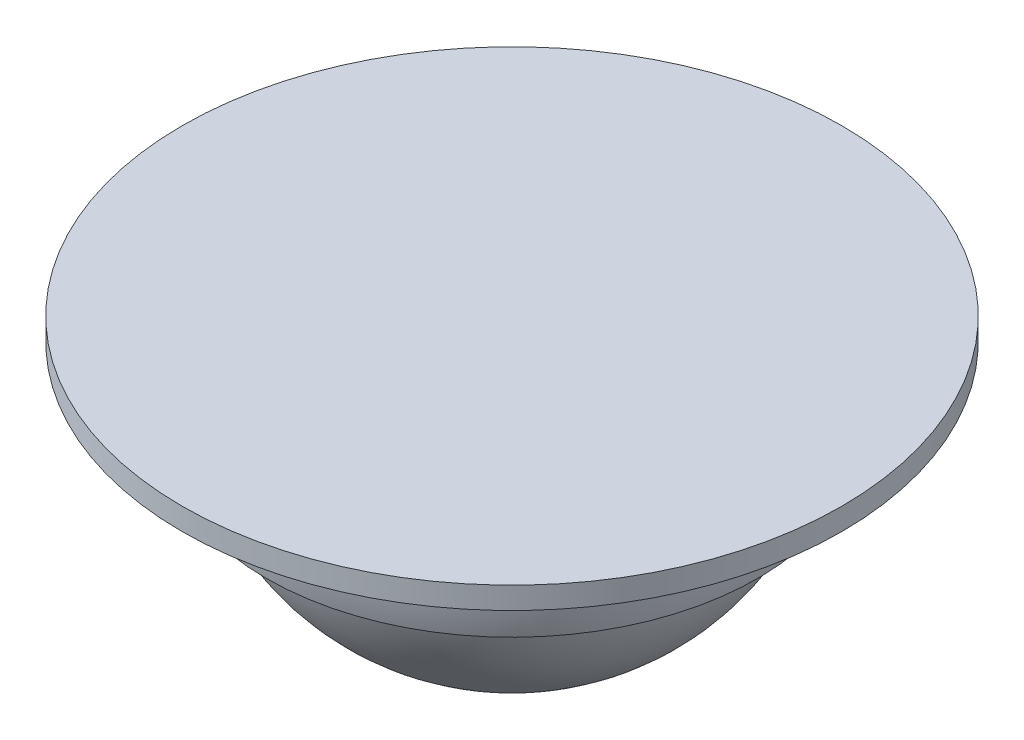
ISO-10303-21;
HEADER;
FILE_DESCRIPTION(('STEP AP214'),'2;1');
FILE_NAME('part.step','',(''),(''),'','','');
FILE_SCHEMA(('AUTOMOTIVE_DESIGN { 1 0 10303 214 1 1 1 1 }'));
ENDSEC;
DATA;
#1=APPLICATION_CONTEXT('core data for automotive mechanical design processes');
#2=APPLICATION_PROTOCOL_DEFINITION('international standard','automotive_design',2000,#1);
#3=PRODUCT_CONTEXT('',#1,'mechanical');
#4=PRODUCT('Part','Part','',(#3));
#5=PRODUCT_RELATED_PRODUCT_CATEGORY('part','',(#4));
#6=PRODUCT_DEFINITION_FORMATION('','',#4);
#7=PRODUCT_DEFINITION_CONTEXT('part definition',#1,'design');
#8=PRODUCT_DEFINITION('design','',#6,#7);
#9=PRODUCT_DEFINITION_SHAPE('','',#8);
#10=(LENGTH_UNIT() NAMED_UNIT(*) SI_UNIT(.MILLI.,.METRE.));
#11=(NAMED_UNIT(*) PLANE_ANGLE_UNIT() SI_UNIT($,.RADIAN.));
#12=(NAMED_UNIT(*) SI_UNIT($,.STERADIAN.) SOLID_ANGLE_UNIT());
#13=UNCERTAINTY_MEASURE_WITH_UNIT(LENGTH_MEASURE(1.E-05),#10,'distance_accuracy_value','');
#14=(GEOMETRIC_REPRESENTATION_CONTEXT(3) GLOBAL_UNCERTAINTY_ASSIGNED_CONTEXT((#13)) GLOBAL_UNIT_ASSIGNED_CONTEXT((#10,
#11,#12)) REPRESENTATION_CONTEXT('',''));
#15=CARTESIAN_POINT('',(0.,0.,0.));
#16=DIRECTION('',(0.,0.,1.));
#17=DIRECTION('',(1.,0.,0.));
#18=AXIS2_PLACEMENT_3D('',#15,#16,#17);
#19=CARTESIAN_POINT('',(0.,-4.,0.));
#20=DIRECTION('',(0.,1.,0.));
#21=DIRECTION('',(-1.,0.,0.));
#22=AXIS2_PLACEMENT_3D('',#19,#20,#21);
#23=SPHERICAL_SURFACE('',#22,21.);
#24=CARTESIAN_POINT('',(0.,-9.53588652349246,0.));
#25=DIRECTION('',(0.,1.,0.));
#26=DIRECTION('',(0.,0.,1.));
#27=AXIS2_PLACEMENT_3D('',#24,#25,#26);
#28=CIRCLE('',#27,20.2571952747416);
#29=CARTESIAN_POINT('',(0.,-9.53588652349246,20.2571952747416));
#30=VERTEX_POINT('',#29);
#31=EDGE_CURVE('E10',#30,#30,#28,.T.);
#32=ORIENTED_EDGE('',*,*,#31,.F.);
#33=EDGE_LOOP('',(#32));
#34=FACE_BOUND('',#33,.T.);
#35=ADVANCED_FACE('F31',(#34),#23,.T.);
#36=CARTESIAN_POINT('',(-20.2571952747416,-9.53588652349245,0.));
#37=DIRECTION('',(0.,-1.,0.));
#38=DIRECTION('',(0.,0.,-1.));
#39=AXIS2_PLACEMENT_3D('',#36,#37,#38);
#40=PLANE('',#39);
#41=ORIENTED_EDGE('',*,*,#31,.T.);
#42=EDGE_LOOP('',(#41));
#43=FACE_BOUND('',#42,.T.);
#44=CARTESIAN_POINT('',(0.,-9.53588652349245,0.));
#45=DIRECTION('',(0.,1.,0.));
#46=DIRECTION('',(0.,0.,1.));
#47=AXIS2_PLACEMENT_3D('',#44,#45,#46);
#48=CIRCLE('',#47,22.3238428680865);
#49=CARTESIAN_POINT('',(0.,-9.53588652349245,22.3238428680865));
#50=VERTEX_POINT('',#49);
#51=EDGE_CURVE('E37',#50,#50,#48,.T.);
#52=ORIENTED_EDGE('',*,*,#51,.F.);
#53=EDGE_LOOP('',(#52));
#54=FACE_BOUND('',#53,.T.);
#55=ADVANCED_FACE('F70',(#43,#54),#40,.T.);
#56=CARTESIAN_POINT('',(0.,-4.,0.));
#57=DIRECTION('',(0.,1.,0.));
#58=DIRECTION('',(-1.,0.,0.));
#59=AXIS2_PLACEMENT_3D('',#56,#57,#58);
#60=SPHERICAL_SURFACE('',#59,23.);
#61=ORIENTED_EDGE('',*,*,#51,.T.);
#62=EDGE_LOOP('',(#61));
#63=FACE_BOUND('',#62,.T.);
#64=CARTESIAN_POINT('',(0.,-2.,0.));
#65=DIRECTION('',(0.,1.,0.));
#66=DIRECTION('',(0.,0.,1.));
#67=AXIS2_PLACEMENT_3D('',#64,#65,#66);
#68=CIRCLE('',#67,22.9128784747792);
#69=CARTESIAN_POINT('',(0.,-2.,22.9128784747792));
#70=VERTEX_POINT('',#69);
#71=EDGE_CURVE('E41',#70,#70,#68,.T.);
#72=ORIENTED_EDGE('',*,*,#71,.F.);
#73=EDGE_LOOP('',(#72));
#74=FACE_BOUND('',#73,.T.);
#75=ADVANCED_FACE('F66',(#63,#74),#60,.T.);
#76=CARTESIAN_POINT('',(-30.,-2.,0.));
#77=DIRECTION('',(0.,-1.,0.));
#78=DIRECTION('',(0.,0.,-1.));
#79=AXIS2_PLACEMENT_3D('',#76,#77,#78);
#80=PLANE('',#79);
#81=ORIENTED_EDGE('',*,*,#71,.T.);
#82=EDGE_LOOP('',(#81));
#83=FACE_BOUND('',#82,.T.);
#84=CARTESIAN_POINT('',(0.,-2.,0.));
#85=DIRECTION('',(0.,1.,0.));
#86=DIRECTION('',(0.,0.,1.));
#87=AXIS2_PLACEMENT_3D('',#84,#85,#86);
#88=CIRCLE('',#87,30.);
#89=CARTESIAN_POINT('',(0.,-2.,30.));
#90=VERTEX_POINT('',#89);
#91=EDGE_CURVE('E45',#90,#90,#88,.T.);
#92=ORIENTED_EDGE('',*,*,#91,.F.);
#93=EDGE_LOOP('',(#92));
#94=FACE_BOUND('',#93,.T.);
#95=ADVANCED_FACE('F58',(#83,#94),#80,.T.);
#96=CARTESIAN_POINT('',(0.,0.,0.));
#97=DIRECTION('',(0.,1.,0.));
#98=DIRECTION('',(0.,0.,1.));
#99=AXIS2_PLACEMENT_3D('',#96,#97,#98);
#100=CYLINDRICAL_SURFACE('',#99,30.);
#101=ORIENTED_EDGE('',*,*,#91,.T.);
#102=EDGE_LOOP('',(#101));
#103=FACE_BOUND('',#102,.T.);
#104=CARTESIAN_POINT('',(0.,0.,0.));
#105=DIRECTION('',(0.,1.,0.));
#106=DIRECTION('',(0.,0.,1.));
#107=AXIS2_PLACEMENT_3D('',#104,#105,#106);
#108=CIRCLE('',#107,30.);
#109=CARTESIAN_POINT('',(0.,0.,30.));
#110=VERTEX_POINT('',#109);
#111=EDGE_CURVE('E50',#110,#110,#108,.T.);
#112=ORIENTED_EDGE('',*,*,#111,.F.);
#113=EDGE_LOOP('',(#112));
#114=FACE_BOUND('',#113,.T.);
#115=ADVANCED_FACE('F56',(#103,#114),#100,.T.);
#116=CARTESIAN_POINT('',(0.,0.,0.));
#117=DIRECTION('',(0.,1.,0.));
#118=DIRECTION('',(0.,0.,1.));
#119=AXIS2_PLACEMENT_3D('',#116,#117,#118);
#120=PLANE('',#119);
#121=ORIENTED_EDGE('',*,*,#111,.T.);
#122=EDGE_LOOP('',(#121));
#123=FACE_BOUND('',#122,.T.);
#124=ADVANCED_FACE('F54',(#123),#120,.T.);
#125=CLOSED_SHELL('',(#35,#55,#75,#95,#115,#124));
#126=MANIFOLD_SOLID_BREP('B2',#125);
#127=ADVANCED_BREP_SHAPE_REPRESENTATION('',(#18,#126),#14);
#128=SHAPE_DEFINITION_REPRESENTATION(#9,#127);
ENDSEC;
END-ISO-10303-21;
